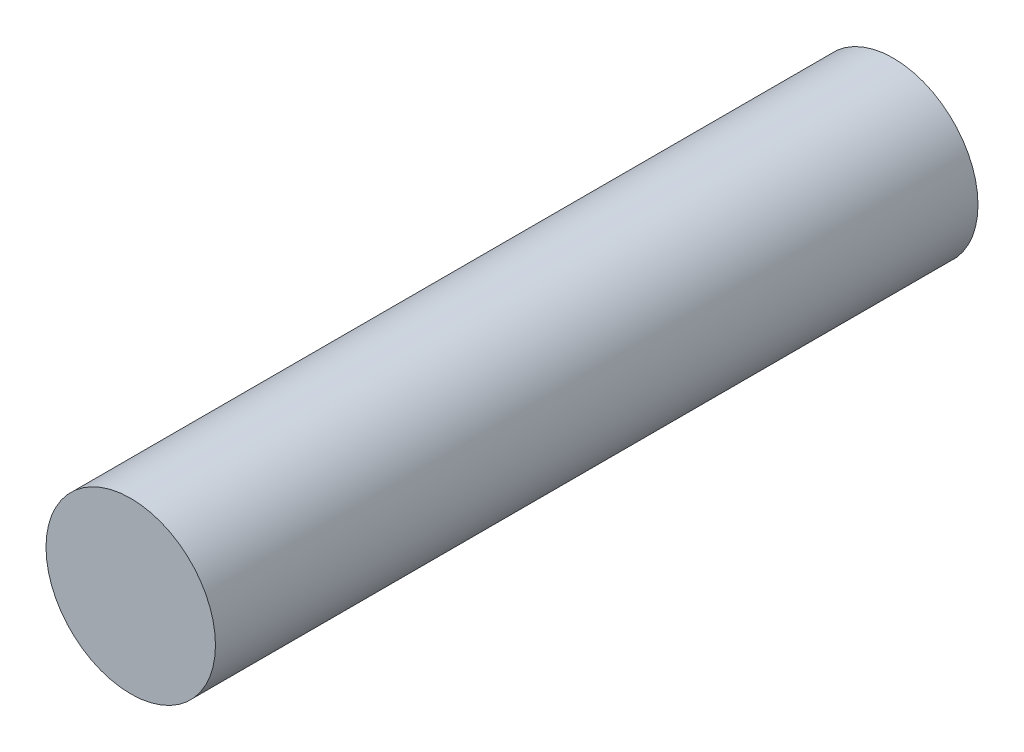
ISO-10303-21;
HEADER;
FILE_DESCRIPTION(('STEP AP214'),'2;1');
FILE_NAME('part.step','',(''),(''),'','','');
FILE_SCHEMA(('AUTOMOTIVE_DESIGN { 1 0 10303 214 1 1 1 1 }'));
ENDSEC;
DATA;
#1=APPLICATION_CONTEXT('core data for automotive mechanical design processes');
#2=APPLICATION_PROTOCOL_DEFINITION('international standard','automotive_design',2000,#1);
#3=PRODUCT_CONTEXT('',#1,'mechanical');
#4=PRODUCT('Part','Part','',(#3));
#5=PRODUCT_RELATED_PRODUCT_CATEGORY('part','',(#4));
#6=PRODUCT_DEFINITION_FORMATION('','',#4);
#7=PRODUCT_DEFINITION_CONTEXT('part definition',#1,'design');
#8=PRODUCT_DEFINITION('design','',#6,#7);
#9=PRODUCT_DEFINITION_SHAPE('','',#8);
#10=(LENGTH_UNIT() NAMED_UNIT(*) SI_UNIT(.MILLI.,.METRE.));
#11=(NAMED_UNIT(*) PLANE_ANGLE_UNIT() SI_UNIT($,.RADIAN.));
#12=(NAMED_UNIT(*) SI_UNIT($,.STERADIAN.) SOLID_ANGLE_UNIT());
#13=UNCERTAINTY_MEASURE_WITH_UNIT(LENGTH_MEASURE(1.E-05),#10,'distance_accuracy_value','');
#14=(GEOMETRIC_REPRESENTATION_CONTEXT(3) GLOBAL_UNCERTAINTY_ASSIGNED_CONTEXT((#13)) GLOBAL_UNIT_ASSIGNED_CONTEXT((#10,
#11,#12)) REPRESENTATION_CONTEXT('',''));
#15=CARTESIAN_POINT('',(0.,0.,0.));
#16=DIRECTION('',(0.,0.,1.));
#17=DIRECTION('',(1.,0.,0.));
#18=AXIS2_PLACEMENT_3D('',#15,#16,#17);
#19=CARTESIAN_POINT('',(0.,0.,18.));
#20=DIRECTION('',(0.,0.,-1.));
#21=DIRECTION('',(-1.,0.,0.));
#22=AXIS2_PLACEMENT_3D('',#19,#20,#21);
#23=CYLINDRICAL_SURFACE('',#22,2.);
#24=CARTESIAN_POINT('',(0.,0.,18.));
#25=DIRECTION('',(0.,0.,1.));
#26=DIRECTION('',(1.,0.,0.));
#27=AXIS2_PLACEMENT_3D('',#24,#25,#26);
#28=CIRCLE('',#27,2.);
#29=CARTESIAN_POINT('',(2.,0.,18.));
#30=VERTEX_POINT('',#29);
#31=EDGE_CURVE('E10',#30,#30,#28,.T.);
#32=ORIENTED_EDGE('',*,*,#31,.F.);
#33=EDGE_LOOP('',(#32));
#34=FACE_BOUND('',#33,.T.);
#35=CARTESIAN_POINT('',(0.,0.,0.));
#36=DIRECTION('',(0.,0.,1.));
#37=DIRECTION('',(1.,0.,0.));
#38=AXIS2_PLACEMENT_3D('',#35,#36,#37);
#39=CIRCLE('',#38,2.);
#40=CARTESIAN_POINT('',(2.,0.,0.));
#41=VERTEX_POINT('',#40);
#42=EDGE_CURVE('E34',#41,#41,#39,.T.);
#43=ORIENTED_EDGE('',*,*,#42,.T.);
#44=EDGE_LOOP('',(#43));
#45=FACE_BOUND('',#44,.T.);
#46=ADVANCED_FACE('F31',(#34,#45),#23,.T.);
#47=CARTESIAN_POINT('',(0.,0.,18.));
#48=DIRECTION('',(0.,0.,1.));
#49=DIRECTION('',(1.,0.,0.));
#50=AXIS2_PLACEMENT_3D('',#47,#48,#49);
#51=PLANE('',#50);
#52=ORIENTED_EDGE('',*,*,#31,.T.);
#53=EDGE_LOOP('',(#52));
#54=FACE_BOUND('',#53,.T.);
#55=ADVANCED_FACE('F46',(#54),#51,.T.);
#56=CARTESIAN_POINT('',(0.,0.,0.));
#57=DIRECTION('',(0.,0.,1.));
#58=DIRECTION('',(1.,0.,0.));
#59=AXIS2_PLACEMENT_3D('',#56,#57,#58);
#60=PLANE('',#59);
#61=ORIENTED_EDGE('',*,*,#42,.F.);
#62=EDGE_LOOP('',(#61));
#63=FACE_BOUND('',#62,.T.);
#64=ADVANCED_FACE('F44',(#63),#60,.F.);
#65=CLOSED_SHELL('',(#46,#55,#64));
#66=MANIFOLD_SOLID_BREP('B2',#65);
#67=ADVANCED_BREP_SHAPE_REPRESENTATION('',(#18,#66),#14);
#68=SHAPE_DEFINITION_REPRESENTATION(#9,#67);
ENDSEC;
END-ISO-10303-21;
